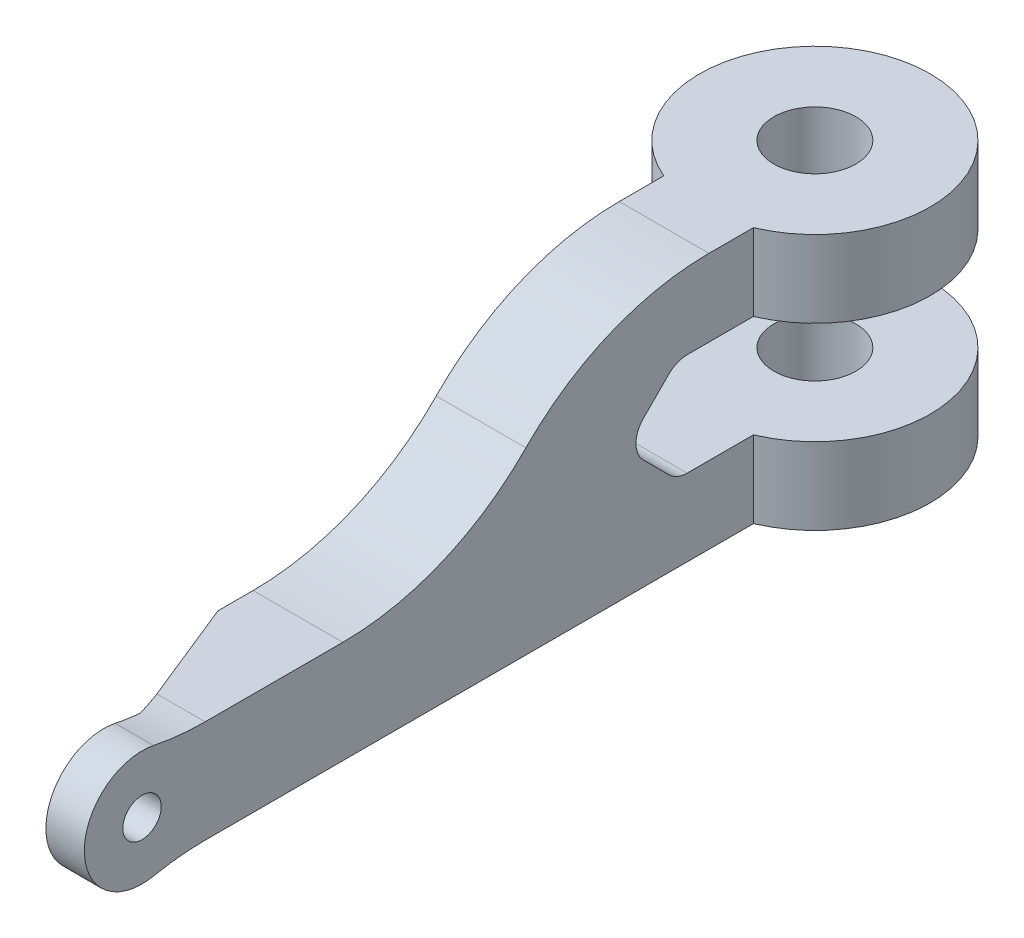
ISO-10303-21;
HEADER;
FILE_DESCRIPTION(('STEP AP214'),'2;1');
FILE_NAME('part.step','',(''),(''),'','','');
FILE_SCHEMA(('AUTOMOTIVE_DESIGN { 1 0 10303 214 1 1 1 1 }'));
ENDSEC;
DATA;
#1=APPLICATION_CONTEXT('core data for automotive mechanical design processes');
#2=APPLICATION_PROTOCOL_DEFINITION('international standard','automotive_design',2000,#1);
#3=PRODUCT_CONTEXT('',#1,'mechanical');
#4=PRODUCT('Part','Part','',(#3));
#5=PRODUCT_RELATED_PRODUCT_CATEGORY('part','',(#4));
#6=PRODUCT_DEFINITION_FORMATION('','',#4);
#7=PRODUCT_DEFINITION_CONTEXT('part definition',#1,'design');
#8=PRODUCT_DEFINITION('design','',#6,#7);
#9=PRODUCT_DEFINITION_SHAPE('','',#8);
#10=(LENGTH_UNIT() NAMED_UNIT(*) SI_UNIT(.MILLI.,.METRE.));
#11=(NAMED_UNIT(*) PLANE_ANGLE_UNIT() SI_UNIT($,.RADIAN.));
#12=(NAMED_UNIT(*) SI_UNIT($,.STERADIAN.) SOLID_ANGLE_UNIT());
#13=UNCERTAINTY_MEASURE_WITH_UNIT(LENGTH_MEASURE(1.E-05),#10,'distance_accuracy_value','');
#14=(GEOMETRIC_REPRESENTATION_CONTEXT(3) GLOBAL_UNCERTAINTY_ASSIGNED_CONTEXT((#13)) GLOBAL_UNIT_ASSIGNED_CONTEXT((#10,
#11,#12)) REPRESENTATION_CONTEXT('',''));
#15=CARTESIAN_POINT('',(0.,0.,0.));
#16=DIRECTION('',(0.,0.,1.));
#17=DIRECTION('',(1.,0.,0.));
#18=AXIS2_PLACEMENT_3D('',#15,#16,#17);
#19=CARTESIAN_POINT('',(0.,3.,0.));
#20=DIRECTION('',(0.,-1.,0.));
#21=DIRECTION('',(0.,0.,-1.));
#22=AXIS2_PLACEMENT_3D('',#19,#20,#21);
#23=CYLINDRICAL_SURFACE('',#22,4.5);
#24=DIRECTION('',(0.,1.,0.));
#25=VECTOR('',#24,1.);
#26=CARTESIAN_POINT('',(1.75,0.,4.14578098794425));
#27=LINE('',#26,#25);
#28=CARTESIAN_POINT('',(1.75,0.,4.14578098794425));
#29=VERTEX_POINT('',#28);
#30=CARTESIAN_POINT('',(1.75,3.,4.14578098794425));
#31=VERTEX_POINT('',#30);
#32=EDGE_CURVE('E215',#29,#31,#27,.T.);
#33=ORIENTED_EDGE('',*,*,#32,.F.);
#34=CARTESIAN_POINT('',(0.,0.,0.));
#35=DIRECTION('',(0.,1.,0.));
#36=DIRECTION('',(0.,0.,1.));
#37=AXIS2_PLACEMENT_3D('',#34,#35,#36);
#38=CIRCLE('',#37,4.5);
#39=CARTESIAN_POINT('',(-1.75,0.,4.14578098794425));
#40=VERTEX_POINT('',#39);
#41=EDGE_CURVE('E228',#29,#40,#38,.T.);
#42=ORIENTED_EDGE('',*,*,#41,.T.);
#43=DIRECTION('',(0.,1.,0.));
#44=VECTOR('',#43,1.);
#45=CARTESIAN_POINT('',(-1.75,0.,4.14578098794425));
#46=LINE('',#45,#44);
#47=CARTESIAN_POINT('',(-1.75,3.,4.14578098794425));
#48=VERTEX_POINT('',#47);
#49=EDGE_CURVE('E219',#40,#48,#46,.T.);
#50=ORIENTED_EDGE('',*,*,#49,.T.);
#51=CARTESIAN_POINT('',(0.,3.,0.));
#52=DIRECTION('',(0.,1.,0.));
#53=DIRECTION('',(0.,0.,1.));
#54=AXIS2_PLACEMENT_3D('',#51,#52,#53);
#55=CIRCLE('',#54,4.5);
#56=EDGE_CURVE('E231',#31,#48,#55,.T.);
#57=ORIENTED_EDGE('',*,*,#56,.F.);
#58=EDGE_LOOP('',(#33,#42,#50,#57));
#59=FACE_BOUND('',#58,.T.);
#60=ADVANCED_FACE('F37',(#59),#23,.T.);
#61=CARTESIAN_POINT('',(0.,3.,0.));
#62=DIRECTION('',(0.,1.,0.));
#63=DIRECTION('',(0.,0.,1.));
#64=AXIS2_PLACEMENT_3D('',#61,#62,#63);
#65=PLANE('',#64);
#66=DIRECTION('',(0.,0.,1.));
#67=VECTOR('',#66,1.);
#68=CARTESIAN_POINT('',(-1.75,3.,7.14578098794425));
#69=LINE('',#68,#67);
#70=CARTESIAN_POINT('',(-1.75,3.,6.73156742557115));
#71=VERTEX_POINT('',#70);
#72=EDGE_CURVE('E183',#48,#71,#69,.T.);
#73=ORIENTED_EDGE('',*,*,#72,.T.);
#74=DIRECTION('',(-1.,0.,0.));
#75=VECTOR('',#74,1.);
#76=CARTESIAN_POINT('',(0.,3.,6.73156742557115));
#77=LINE('',#76,#75);
#78=CARTESIAN_POINT('',(1.75,3.,6.73156742557115));
#79=VERTEX_POINT('',#78);
#80=EDGE_CURVE('E280',#71,#79,#77,.F.);
#81=ORIENTED_EDGE('',*,*,#80,.T.);
#82=DIRECTION('',(0.,0.,1.));
#83=VECTOR('',#82,1.);
#84=CARTESIAN_POINT('',(1.75,3.,0.));
#85=LINE('',#84,#83);
#86=EDGE_CURVE('E359',#31,#79,#85,.T.);
#87=ORIENTED_EDGE('',*,*,#86,.F.);
#88=ORIENTED_EDGE('',*,*,#56,.T.);
#89=EDGE_LOOP('',(#73,#81,#87,#88));
#90=FACE_BOUND('',#89,.T.);
#91=CARTESIAN_POINT('',(0.,3.,0.));
#92=DIRECTION('',(0.,1.,0.));
#93=DIRECTION('',(0.,0.,1.));
#94=AXIS2_PLACEMENT_3D('',#91,#92,#93);
#95=CIRCLE('',#94,1.6);
#96=CARTESIAN_POINT('',(0.,3.,1.6));
#97=VERTEX_POINT('',#96);
#98=EDGE_CURVE('E225',#97,#97,#95,.T.);
#99=ORIENTED_EDGE('',*,*,#98,.F.);
#100=EDGE_LOOP('',(#99));
#101=FACE_BOUND('',#100,.T.);
#102=ADVANCED_FACE('F387',(#90,#101),#65,.T.);
#103=CARTESIAN_POINT('',(0.,0.,0.));
#104=DIRECTION('',(0.,1.,0.));
#105=DIRECTION('',(0.,0.,1.));
#106=AXIS2_PLACEMENT_3D('',#103,#104,#105);
#107=PLANE('',#106);
#108=DIRECTION('',(1.,0.,0.));
#109=VECTOR('',#108,1.);
#110=CARTESIAN_POINT('',(-1.75,0.,25.537785549551));
#111=LINE('',#110,#109);
#112=CARTESIAN_POINT('',(-0.133895096659366,0.,25.537785549551));
#113=VERTEX_POINT('',#112);
#114=CARTESIAN_POINT('',(-0.129999999999994,0.,25.537785549551));
#115=VERTEX_POINT('',#114);
#116=EDGE_CURVE('E324',#113,#115,#111,.T.);
#117=ORIENTED_EDGE('',*,*,#116,.F.);
#118=DIRECTION('',(-0.37460659341591,0.,-0.927183854566788));
#119=VECTOR('',#118,1.);
#120=CARTESIAN_POINT('',(-0.133895096659366,0.,25.537785549551));
#121=LINE('',#120,#119);
#122=CARTESIAN_POINT('',(-1.75,0.,21.5377855495509));
#123=VERTEX_POINT('',#122);
#124=EDGE_CURVE('E297',#113,#123,#121,.T.);
#125=ORIENTED_EDGE('',*,*,#124,.T.);
#126=DIRECTION('',(0.,0.,1.));
#127=VECTOR('',#126,1.);
#128=CARTESIAN_POINT('',(-1.75,0.,0.));
#129=LINE('',#128,#127);
#130=EDGE_CURVE('E213',#40,#123,#129,.T.);
#131=ORIENTED_EDGE('',*,*,#130,.F.);
#132=ORIENTED_EDGE('',*,*,#41,.F.);
#133=DIRECTION('',(0.,0.,1.));
#134=VECTOR('',#133,1.);
#135=CARTESIAN_POINT('',(1.75,0.,0.));
#136=LINE('',#135,#134);
#137=CARTESIAN_POINT('',(1.75,0.,25.537785549551));
#138=VERTEX_POINT('',#137);
#139=EDGE_CURVE('E211',#29,#138,#136,.T.);
#140=ORIENTED_EDGE('',*,*,#139,.T.);
#141=DIRECTION('',(1.,0.,0.));
#142=VECTOR('',#141,1.);
#143=CARTESIAN_POINT('',(0.,0.,25.537785549551));
#144=LINE('',#143,#142);
#145=EDGE_CURVE('E53',#138,#115,#144,.F.);
#146=ORIENTED_EDGE('',*,*,#145,.T.);
#147=EDGE_LOOP('',(#117,#125,#131,#132,#140,#146));
#148=FACE_BOUND('',#147,.T.);
#149=CARTESIAN_POINT('',(0.,0.,0.));
#150=DIRECTION('',(0.,1.,0.));
#151=DIRECTION('',(0.,0.,1.));
#152=AXIS2_PLACEMENT_3D('',#149,#150,#151);
#153=CIRCLE('',#152,1.6);
#154=CARTESIAN_POINT('',(0.,0.,1.6));
#155=VERTEX_POINT('',#154);
#156=EDGE_CURVE('E222',#155,#155,#153,.T.);
#157=ORIENTED_EDGE('',*,*,#156,.T.);
#158=EDGE_LOOP('',(#157));
#159=FACE_BOUND('',#158,.T.);
#160=ADVANCED_FACE('F394',(#148,#159),#107,.F.);
#161=CARTESIAN_POINT('',(0.,3.,0.));
#162=DIRECTION('',(0.,-1.,0.));
#163=DIRECTION('',(0.,0.,-1.));
#164=AXIS2_PLACEMENT_3D('',#161,#162,#163);
#165=CYLINDRICAL_SURFACE('',#164,1.6);
#166=ORIENTED_EDGE('',*,*,#98,.T.);
#167=EDGE_LOOP('',(#166));
#168=FACE_BOUND('',#167,.T.);
#169=ORIENTED_EDGE('',*,*,#156,.F.);
#170=EDGE_LOOP('',(#169));
#171=FACE_BOUND('',#170,.T.);
#172=ADVANCED_FACE('F553',(#168,#171),#165,.F.);
#173=CARTESIAN_POINT('',(1.75,0.,0.));
#174=DIRECTION('',(-1.,0.,0.));
#175=DIRECTION('',(0.,0.,1.));
#176=AXIS2_PLACEMENT_3D('',#173,#174,#175);
#177=PLANE('',#176);
#178=DIRECTION('',(0.,0.,1.));
#179=VECTOR('',#178,1.);
#180=CARTESIAN_POINT('',(1.75,10.,0.));
#181=LINE('',#180,#179);
#182=CARTESIAN_POINT('',(1.75,10.,4.14578098794425));
#183=VERTEX_POINT('',#182);
#184=CARTESIAN_POINT('',(1.75,10.,5.88229453282598));
#185=VERTEX_POINT('',#184);
#186=EDGE_CURVE('E210',#183,#185,#181,.T.);
#187=ORIENTED_EDGE('',*,*,#186,.T.);
#188=CARTESIAN_POINT('',(1.75,0.,5.88229453282598));
#189=DIRECTION('',(-1.,0.,0.));
#190=DIRECTION('',(0.,0.,1.));
#191=AXIS2_PLACEMENT_3D('',#188,#189,#190);
#192=CIRCLE('',#191,10.);
#193=CARTESIAN_POINT('',(1.75,7.,13.0237229613688));
#194=VERTEX_POINT('',#193);
#195=EDGE_CURVE('E263',#185,#194,#192,.F.);
#196=ORIENTED_EDGE('',*,*,#195,.T.);
#197=CARTESIAN_POINT('',(1.75,14.,20.1651513899117));
#198=DIRECTION('',(-1.,0.,0.));
#199=DIRECTION('',(0.,0.,1.));
#200=AXIS2_PLACEMENT_3D('',#197,#198,#199);
#201=CIRCLE('',#200,10.);
#202=CARTESIAN_POINT('',(1.75,4.,20.1651513899117));
#203=VERTEX_POINT('',#202);
#204=EDGE_CURVE('E249',#194,#203,#201,.T.);
#205=ORIENTED_EDGE('',*,*,#204,.T.);
#206=DIRECTION('',(0.,0.,-1.));
#207=VECTOR('',#206,1.);
#208=CARTESIAN_POINT('',(1.75,4.,28.));
#209=LINE('',#208,#207);
#210=CARTESIAN_POINT('',(1.75,4.,25.537785549551));
#211=VERTEX_POINT('',#210);
#212=EDGE_CURVE('E184',#211,#203,#209,.T.);
#213=ORIENTED_EDGE('',*,*,#212,.F.);
#214=CARTESIAN_POINT('',(1.75,14.,25.537785549551));
#215=DIRECTION('',(-1.,0.,0.));
#216=DIRECTION('',(0.,0.,1.));
#217=AXIS2_PLACEMENT_3D('',#214,#215,#216);
#218=CIRCLE('',#217,10.);
#219=CARTESIAN_POINT('',(1.75,4.20408163265306,27.5477565295094));
#220=VERTEX_POINT('',#219);
#221=EDGE_CURVE('E251',#211,#220,#218,.T.);
#222=ORIENTED_EDGE('',*,*,#221,.T.);
#223=CARTESIAN_POINT('',(1.75,2.,28.));
#224=DIRECTION('',(1.,0.,0.));
#225=DIRECTION('',(0.,0.,-1.));
#226=AXIS2_PLACEMENT_3D('',#223,#224,#225);
#227=CIRCLE('',#226,2.25);
#228=CARTESIAN_POINT('',(1.75,-0.204081632653063,27.5477565295094));
#229=VERTEX_POINT('',#228);
#230=EDGE_CURVE('E334',#220,#229,#227,.T.);
#231=ORIENTED_EDGE('',*,*,#230,.T.);
#232=CARTESIAN_POINT('',(1.75,-10.,25.537785549551));
#233=DIRECTION('',(-1.,0.,0.));
#234=DIRECTION('',(0.,0.,1.));
#235=AXIS2_PLACEMENT_3D('',#232,#233,#234);
#236=CIRCLE('',#235,10.);
#237=EDGE_CURVE('E258',#229,#138,#236,.T.);
#238=ORIENTED_EDGE('',*,*,#237,.T.);
#239=ORIENTED_EDGE('',*,*,#139,.F.);
#240=ORIENTED_EDGE('',*,*,#32,.T.);
#241=ORIENTED_EDGE('',*,*,#86,.T.);
#242=CARTESIAN_POINT('',(1.75,4.,6.73156742557115));
#243=DIRECTION('',(-1.,0.,0.));
#244=DIRECTION('',(0.,0.,1.));
#245=AXIS2_PLACEMENT_3D('',#242,#243,#244);
#246=CIRCLE('',#245,1.);
#247=CARTESIAN_POINT('',(1.75,3.29289321881345,7.4386742067577));
#248=VERTEX_POINT('',#247);
#249=EDGE_CURVE('E292',#79,#248,#246,.T.);
#250=ORIENTED_EDGE('',*,*,#249,.T.);
#251=DIRECTION('',(0.,0.707106781186548,0.707106781186547));
#252=VECTOR('',#251,1.);
#253=CARTESIAN_POINT('',(1.75,-2.07289049397213,2.07289049397213));
#254=LINE('',#253,#252);
#255=CARTESIAN_POINT('',(1.75,4.29289321881345,8.4386742067577));
#256=VERTEX_POINT('',#255);
#257=EDGE_CURVE('E362',#248,#256,#254,.T.);
#258=ORIENTED_EDGE('',*,*,#257,.T.);
#259=CARTESIAN_POINT('',(1.75,5.,7.73156742557115));
#260=DIRECTION('',(-1.,0.,0.));
#261=DIRECTION('',(0.,0.,1.));
#262=AXIS2_PLACEMENT_3D('',#259,#260,#261);
#263=CIRCLE('',#262,1.);
#264=CARTESIAN_POINT('',(1.75,5.70710678118655,8.4386742067577));
#265=VERTEX_POINT('',#264);
#266=EDGE_CURVE('E288',#256,#265,#263,.T.);
#267=ORIENTED_EDGE('',*,*,#266,.T.);
#268=DIRECTION('',(0.,0.707106781186548,-0.707106781186547));
#269=VECTOR('',#268,1.);
#270=CARTESIAN_POINT('',(1.75,7.07289049397212,7.07289049397213));
#271=LINE('',#270,#269);
#272=CARTESIAN_POINT('',(1.75,6.70710678118655,7.4386742067577));
#273=VERTEX_POINT('',#272);
#274=EDGE_CURVE('E365',#265,#273,#271,.T.);
#275=ORIENTED_EDGE('',*,*,#274,.T.);
#276=CARTESIAN_POINT('',(1.75,6.,6.73156742557115));
#277=DIRECTION('',(-1.,0.,0.));
#278=DIRECTION('',(0.,0.,1.));
#279=AXIS2_PLACEMENT_3D('',#276,#277,#278);
#280=CIRCLE('',#279,1.);
#281=CARTESIAN_POINT('',(1.75,7.,6.73156742557115));
#282=VERTEX_POINT('',#281);
#283=EDGE_CURVE('E284',#273,#282,#280,.T.);
#284=ORIENTED_EDGE('',*,*,#283,.T.);
#285=DIRECTION('',(0.,0.,-1.));
#286=VECTOR('',#285,1.);
#287=CARTESIAN_POINT('',(1.75,7.,0.));
#288=LINE('',#287,#286);
#289=CARTESIAN_POINT('',(1.75,7.,4.14578098794425));
#290=VERTEX_POINT('',#289);
#291=EDGE_CURVE('E357',#282,#290,#288,.T.);
#292=ORIENTED_EDGE('',*,*,#291,.T.);
#293=DIRECTION('',(0.,-1.,0.));
#294=VECTOR('',#293,1.);
#295=CARTESIAN_POINT('',(1.75,10.,4.14578098794425));
#296=LINE('',#295,#294);
#297=EDGE_CURVE('E195',#183,#290,#296,.T.);
#298=ORIENTED_EDGE('',*,*,#297,.F.);
#299=EDGE_LOOP('',(#187,#196,#205,#213,#222,#231,#238,#239,#240,#241,#250,#258,#267,#275,#284,
#292,#298));
#300=FACE_BOUND('',#299,.T.);
#301=CARTESIAN_POINT('',(1.75,2.,28.));
#302=DIRECTION('',(1.,0.,0.));
#303=DIRECTION('',(0.,0.,-1.));
#304=AXIS2_PLACEMENT_3D('',#301,#302,#303);
#305=CIRCLE('',#304,0.750000000000002);
#306=CARTESIAN_POINT('',(1.75,2.,27.25));
#307=VERTEX_POINT('',#306);
#308=EDGE_CURVE('E341',#307,#307,#305,.T.);
#309=ORIENTED_EDGE('',*,*,#308,.F.);
#310=EDGE_LOOP('',(#309));
#311=FACE_BOUND('',#310,.T.);
#312=ADVANCED_FACE('F446',(#300,#311),#177,.F.);
#313=CARTESIAN_POINT('',(-1.75,0.,0.));
#314=DIRECTION('',(-1.,0.,0.));
#315=DIRECTION('',(0.,0.,1.));
#316=AXIS2_PLACEMENT_3D('',#313,#314,#315);
#317=PLANE('',#316);
#318=ORIENTED_EDGE('',*,*,#130,.T.);
#319=DIRECTION('',(0.,1.,0.));
#320=VECTOR('',#319,1.);
#321=CARTESIAN_POINT('',(-1.75,4.,21.5377855495509));
#322=LINE('',#321,#320);
#323=CARTESIAN_POINT('',(-1.75,4.,21.5377855495509));
#324=VERTEX_POINT('',#323);
#325=EDGE_CURVE('E299',#123,#324,#322,.T.);
#326=ORIENTED_EDGE('',*,*,#325,.T.);
#327=DIRECTION('',(0.,0.,-1.));
#328=VECTOR('',#327,1.);
#329=CARTESIAN_POINT('',(-1.75,4.,28.));
#330=LINE('',#329,#328);
#331=CARTESIAN_POINT('',(-1.75,4.,20.1651513899117));
#332=VERTEX_POINT('',#331);
#333=EDGE_CURVE('E346',#324,#332,#330,.T.);
#334=ORIENTED_EDGE('',*,*,#333,.T.);
#335=CARTESIAN_POINT('',(-1.75,14.,20.1651513899117));
#336=DIRECTION('',(-1.,0.,0.));
#337=DIRECTION('',(0.,0.,1.));
#338=AXIS2_PLACEMENT_3D('',#335,#336,#337);
#339=CIRCLE('',#338,10.);
#340=CARTESIAN_POINT('',(-1.75,7.,13.0237229613688));
#341=VERTEX_POINT('',#340);
#342=EDGE_CURVE('E246',#332,#341,#339,.F.);
#343=ORIENTED_EDGE('',*,*,#342,.T.);
#344=CARTESIAN_POINT('',(-1.75,0.,5.88229453282598));
#345=DIRECTION('',(-1.,0.,0.));
#346=DIRECTION('',(0.,0.,1.));
#347=AXIS2_PLACEMENT_3D('',#344,#345,#346);
#348=CIRCLE('',#347,10.);
#349=CARTESIAN_POINT('',(-1.75,10.,5.88229453282598));
#350=VERTEX_POINT('',#349);
#351=EDGE_CURVE('E267',#341,#350,#348,.T.);
#352=ORIENTED_EDGE('',*,*,#351,.T.);
#353=DIRECTION('',(0.,0.,1.));
#354=VECTOR('',#353,1.);
#355=CARTESIAN_POINT('',(-1.75,10.,0.));
#356=LINE('',#355,#354);
#357=CARTESIAN_POINT('',(-1.75,10.,4.14578098794425));
#358=VERTEX_POINT('',#357);
#359=EDGE_CURVE('E191',#358,#350,#356,.T.);
#360=ORIENTED_EDGE('',*,*,#359,.F.);
#361=DIRECTION('',(0.,-1.,0.));
#362=VECTOR('',#361,1.);
#363=CARTESIAN_POINT('',(-1.75,10.,4.14578098794425));
#364=LINE('',#363,#362);
#365=CARTESIAN_POINT('',(-1.75,7.,4.14578098794425));
#366=VERTEX_POINT('',#365);
#367=EDGE_CURVE('E187',#358,#366,#364,.T.);
#368=ORIENTED_EDGE('',*,*,#367,.T.);
#369=DIRECTION('',(0.,0.,-1.));
#370=VECTOR('',#369,1.);
#371=CARTESIAN_POINT('',(-1.75,7.,4.14578098794425));
#372=LINE('',#371,#370);
#373=CARTESIAN_POINT('',(-1.75,7.,6.73156742557115));
#374=VERTEX_POINT('',#373);
#375=EDGE_CURVE('E173',#374,#366,#372,.T.);
#376=ORIENTED_EDGE('',*,*,#375,.F.);
#377=CARTESIAN_POINT('',(-1.75,6.,6.73156742557115));
#378=DIRECTION('',(-1.,0.,0.));
#379=DIRECTION('',(0.,0.,1.));
#380=AXIS2_PLACEMENT_3D('',#377,#378,#379);
#381=CIRCLE('',#380,1.);
#382=CARTESIAN_POINT('',(-1.75,6.70710678118655,7.4386742067577));
#383=VERTEX_POINT('',#382);
#384=EDGE_CURVE('E282',#374,#383,#381,.F.);
#385=ORIENTED_EDGE('',*,*,#384,.T.);
#386=DIRECTION('',(0.,0.707106781186548,-0.707106781186547));
#387=VECTOR('',#386,1.);
#388=CARTESIAN_POINT('',(-1.75,7.,7.14578098794425));
#389=LINE('',#388,#387);
#390=CARTESIAN_POINT('',(-1.75,5.70710678118655,8.4386742067577));
#391=VERTEX_POINT('',#390);
#392=EDGE_CURVE('E354',#391,#383,#389,.T.);
#393=ORIENTED_EDGE('',*,*,#392,.F.);
#394=CARTESIAN_POINT('',(-1.75,5.,7.73156742557115));
#395=DIRECTION('',(-1.,0.,0.));
#396=DIRECTION('',(0.,0.,1.));
#397=AXIS2_PLACEMENT_3D('',#394,#395,#396);
#398=CIRCLE('',#397,1.);
#399=CARTESIAN_POINT('',(-1.75,4.29289321881345,8.4386742067577));
#400=VERTEX_POINT('',#399);
#401=EDGE_CURVE('E286',#391,#400,#398,.F.);
#402=ORIENTED_EDGE('',*,*,#401,.T.);
#403=DIRECTION('',(0.,0.707106781186548,0.707106781186547));
#404=VECTOR('',#403,1.);
#405=CARTESIAN_POINT('',(-1.75,5.,9.14578098794425));
#406=LINE('',#405,#404);
#407=CARTESIAN_POINT('',(-1.75,3.29289321881345,7.4386742067577));
#408=VERTEX_POINT('',#407);
#409=EDGE_CURVE('E351',#408,#400,#406,.T.);
#410=ORIENTED_EDGE('',*,*,#409,.F.);
#411=CARTESIAN_POINT('',(-1.75,4.,6.73156742557115));
#412=DIRECTION('',(-1.,0.,0.));
#413=DIRECTION('',(0.,0.,1.));
#414=AXIS2_PLACEMENT_3D('',#411,#412,#413);
#415=CIRCLE('',#414,1.);
#416=EDGE_CURVE('E290',#408,#71,#415,.F.);
#417=ORIENTED_EDGE('',*,*,#416,.T.);
#418=ORIENTED_EDGE('',*,*,#72,.F.);
#419=ORIENTED_EDGE('',*,*,#49,.F.);
#420=EDGE_LOOP('',(#318,#326,#334,#343,#352,#360,#368,#376,#385,#393,#402,#410,#417,#418,#419));
#421=FACE_BOUND('',#420,.T.);
#422=ADVANCED_FACE('F189',(#421),#317,.T.);
#423=CARTESIAN_POINT('',(0.,10.,0.));
#424=DIRECTION('',(0.,1.,0.));
#425=DIRECTION('',(0.,0.,1.));
#426=AXIS2_PLACEMENT_3D('',#423,#424,#425);
#427=PLANE('',#426);
#428=ORIENTED_EDGE('',*,*,#359,.T.);
#429=DIRECTION('',(1.,0.,0.));
#430=VECTOR('',#429,1.);
#431=CARTESIAN_POINT('',(1.75,10.,5.88229453282598));
#432=LINE('',#431,#430);
#433=EDGE_CURVE('E260',#350,#185,#432,.T.);
#434=ORIENTED_EDGE('',*,*,#433,.T.);
#435=ORIENTED_EDGE('',*,*,#186,.F.);
#436=CARTESIAN_POINT('',(0.,10.,0.));
#437=DIRECTION('',(0.,1.,0.));
#438=DIRECTION('',(0.,0.,1.));
#439=AXIS2_PLACEMENT_3D('',#436,#437,#438);
#440=CIRCLE('',#439,4.5);
#441=EDGE_CURVE('E196',#183,#358,#440,.T.);
#442=ORIENTED_EDGE('',*,*,#441,.T.);
#443=EDGE_LOOP('',(#428,#434,#435,#442));
#444=FACE_BOUND('',#443,.T.);
#445=CARTESIAN_POINT('',(0.,10.,0.));
#446=DIRECTION('',(0.,1.,0.));
#447=DIRECTION('',(0.,0.,1.));
#448=AXIS2_PLACEMENT_3D('',#445,#446,#447);
#449=CIRCLE('',#448,1.6);
#450=CARTESIAN_POINT('',(0.,10.,1.6));
#451=VERTEX_POINT('',#450);
#452=EDGE_CURVE('E201',#451,#451,#449,.T.);
#453=ORIENTED_EDGE('',*,*,#452,.F.);
#454=EDGE_LOOP('',(#453));
#455=FACE_BOUND('',#454,.T.);
#456=ADVANCED_FACE('F461',(#444,#455),#427,.T.);
#457=CARTESIAN_POINT('',(0.,10.,0.));
#458=DIRECTION('',(0.,-1.,0.));
#459=DIRECTION('',(0.,0.,-1.));
#460=AXIS2_PLACEMENT_3D('',#457,#458,#459);
#461=CYLINDRICAL_SURFACE('',#460,4.5);
#462=ORIENTED_EDGE('',*,*,#441,.F.);
#463=ORIENTED_EDGE('',*,*,#297,.T.);
#464=CARTESIAN_POINT('',(0.,7.,0.));
#465=DIRECTION('',(0.,1.,0.));
#466=DIRECTION('',(0.,0.,1.));
#467=AXIS2_PLACEMENT_3D('',#464,#465,#466);
#468=CIRCLE('',#467,4.5);
#469=EDGE_CURVE('E179',#290,#366,#468,.T.);
#470=ORIENTED_EDGE('',*,*,#469,.T.);
#471=ORIENTED_EDGE('',*,*,#367,.F.);
#472=EDGE_LOOP('',(#462,#463,#470,#471));
#473=FACE_BOUND('',#472,.T.);
#474=ADVANCED_FACE('F199',(#473),#461,.T.);
#475=CARTESIAN_POINT('',(0.,7.,0.));
#476=DIRECTION('',(0.,1.,0.));
#477=DIRECTION('',(0.,0.,1.));
#478=AXIS2_PLACEMENT_3D('',#475,#476,#477);
#479=PLANE('',#478);
#480=ORIENTED_EDGE('',*,*,#291,.F.);
#481=DIRECTION('',(-1.,0.,0.));
#482=VECTOR('',#481,1.);
#483=CARTESIAN_POINT('',(-1.75,7.,6.73156742557115));
#484=LINE('',#483,#482);
#485=EDGE_CURVE('E181',#282,#374,#484,.T.);
#486=ORIENTED_EDGE('',*,*,#485,.T.);
#487=ORIENTED_EDGE('',*,*,#375,.T.);
#488=ORIENTED_EDGE('',*,*,#469,.F.);
#489=EDGE_LOOP('',(#480,#486,#487,#488));
#490=FACE_BOUND('',#489,.T.);
#491=CARTESIAN_POINT('',(0.,7.,0.));
#492=DIRECTION('',(0.,1.,0.));
#493=DIRECTION('',(0.,0.,1.));
#494=AXIS2_PLACEMENT_3D('',#491,#492,#493);
#495=CIRCLE('',#494,1.6);
#496=CARTESIAN_POINT('',(0.,7.,1.6));
#497=VERTEX_POINT('',#496);
#498=EDGE_CURVE('E205',#497,#497,#495,.T.);
#499=ORIENTED_EDGE('',*,*,#498,.T.);
#500=EDGE_LOOP('',(#499));
#501=FACE_BOUND('',#500,.T.);
#502=ADVANCED_FACE('F176',(#490,#501),#479,.F.);
#503=CARTESIAN_POINT('',(0.,10.,0.));
#504=DIRECTION('',(0.,-1.,0.));
#505=DIRECTION('',(0.,0.,-1.));
#506=AXIS2_PLACEMENT_3D('',#503,#504,#505);
#507=CYLINDRICAL_SURFACE('',#506,1.6);
#508=ORIENTED_EDGE('',*,*,#452,.T.);
#509=EDGE_LOOP('',(#508));
#510=FACE_BOUND('',#509,.T.);
#511=ORIENTED_EDGE('',*,*,#498,.F.);
#512=EDGE_LOOP('',(#511));
#513=FACE_BOUND('',#512,.T.);
#514=ADVANCED_FACE('F370',(#510,#513),#507,.F.);
#515=CARTESIAN_POINT('',(4.5,7.,7.14578098794425));
#516=DIRECTION('',(0.,0.707106781186547,0.707106781186548));
#517=DIRECTION('',(0.,-0.707106781186548,0.707106781186547));
#518=AXIS2_PLACEMENT_3D('',#515,#516,#517);
#519=PLANE('',#518);
#520=ORIENTED_EDGE('',*,*,#392,.T.);
#521=DIRECTION('',(-1.,0.,0.));
#522=VECTOR('',#521,1.);
#523=CARTESIAN_POINT('',(1.75,6.70710678118655,7.4386742067577));
#524=LINE('',#523,#522);
#525=EDGE_CURVE('E273',#383,#273,#524,.F.);
#526=ORIENTED_EDGE('',*,*,#525,.T.);
#527=ORIENTED_EDGE('',*,*,#274,.F.);
#528=DIRECTION('',(-1.,0.,0.));
#529=VECTOR('',#528,1.);
#530=CARTESIAN_POINT('',(-1.75,5.70710678118655,8.4386742067577));
#531=LINE('',#530,#529);
#532=EDGE_CURVE('E270',#265,#391,#531,.T.);
#533=ORIENTED_EDGE('',*,*,#532,.T.);
#534=EDGE_LOOP('',(#520,#526,#527,#533));
#535=FACE_BOUND('',#534,.T.);
#536=ADVANCED_FACE('F372',(#535),#519,.F.);
#537=CARTESIAN_POINT('',(4.5,5.,9.14578098794425));
#538=DIRECTION('',(0.,-0.707106781186547,0.707106781186548));
#539=DIRECTION('',(0.,-0.707106781186548,-0.707106781186547));
#540=AXIS2_PLACEMENT_3D('',#537,#538,#539);
#541=PLANE('',#540);
#542=ORIENTED_EDGE('',*,*,#409,.T.);
#543=DIRECTION('',(-1.,0.,0.));
#544=VECTOR('',#543,1.);
#545=CARTESIAN_POINT('',(1.75,4.29289321881345,8.4386742067577));
#546=LINE('',#545,#544);
#547=EDGE_CURVE('E278',#400,#256,#546,.F.);
#548=ORIENTED_EDGE('',*,*,#547,.T.);
#549=ORIENTED_EDGE('',*,*,#257,.F.);
#550=DIRECTION('',(-1.,0.,0.));
#551=VECTOR('',#550,1.);
#552=CARTESIAN_POINT('',(4.5,3.29289321881345,7.4386742067577));
#553=LINE('',#552,#551);
#554=EDGE_CURVE('E275',#248,#408,#553,.T.);
#555=ORIENTED_EDGE('',*,*,#554,.T.);
#556=EDGE_LOOP('',(#542,#548,#549,#555));
#557=FACE_BOUND('',#556,.T.);
#558=ADVANCED_FACE('F380',(#557),#541,.F.);
#559=CARTESIAN_POINT('',(-1.75,4.,28.));
#560=DIRECTION('',(0.,-1.,0.));
#561=DIRECTION('',(0.,0.,-1.));
#562=AXIS2_PLACEMENT_3D('',#559,#560,#561);
#563=PLANE('',#562);
#564=ORIENTED_EDGE('',*,*,#333,.F.);
#565=DIRECTION('',(0.37460659341591,0.,0.927183854566788));
#566=VECTOR('',#565,1.);
#567=CARTESIAN_POINT('',(-0.133895096659366,4.,25.537785549551));
#568=LINE('',#567,#566);
#569=CARTESIAN_POINT('',(-0.133895096659366,4.,25.537785549551));
#570=VERTEX_POINT('',#569);
#571=EDGE_CURVE('E301',#324,#570,#568,.T.);
#572=ORIENTED_EDGE('',*,*,#571,.T.);
#573=DIRECTION('',(1.,0.,0.));
#574=VECTOR('',#573,1.);
#575=CARTESIAN_POINT('',(-1.75,4.,25.537785549551));
#576=LINE('',#575,#574);
#577=CARTESIAN_POINT('',(-0.129999999999994,4.,25.537785549551));
#578=VERTEX_POINT('',#577);
#579=EDGE_CURVE('E322',#570,#578,#576,.T.);
#580=ORIENTED_EDGE('',*,*,#579,.T.);
#581=DIRECTION('',(1.,0.,0.));
#582=VECTOR('',#581,1.);
#583=CARTESIAN_POINT('',(-1.75,4.,25.537785549551));
#584=LINE('',#583,#582);
#585=EDGE_CURVE('E234',#578,#211,#584,.T.);
#586=ORIENTED_EDGE('',*,*,#585,.T.);
#587=ORIENTED_EDGE('',*,*,#212,.T.);
#588=DIRECTION('',(-1.,0.,0.));
#589=VECTOR('',#588,1.);
#590=CARTESIAN_POINT('',(-1.75,4.,20.1651513899117));
#591=LINE('',#590,#589);
#592=EDGE_CURVE('E238',#203,#332,#591,.T.);
#593=ORIENTED_EDGE('',*,*,#592,.T.);
#594=EDGE_LOOP('',(#564,#572,#580,#586,#587,#593));
#595=FACE_BOUND('',#594,.T.);
#596=ADVANCED_FACE('F327',(#595),#563,.F.);
#597=CARTESIAN_POINT('',(-4.5,2.,28.));
#598=DIRECTION('',(1.,0.,0.));
#599=DIRECTION('',(0.,0.,-1.));
#600=AXIS2_PLACEMENT_3D('',#597,#598,#599);
#601=CYLINDRICAL_SURFACE('',#600,0.750000000000002);
#602=CARTESIAN_POINT('',(0.250000000000003,2.,28.));
#603=DIRECTION('',(1.,0.,0.));
#604=DIRECTION('',(0.,0.,-1.));
#605=AXIS2_PLACEMENT_3D('',#602,#603,#604);
#606=CIRCLE('',#605,0.750000000000002);
#607=CARTESIAN_POINT('',(0.250000000000004,2.,27.25));
#608=VERTEX_POINT('',#607);
#609=EDGE_CURVE('E331',#608,#608,#606,.T.);
#610=CARTESIAN_POINT('',(1.75,2.,27.25));
#611=CARTESIAN_POINT('',(1.734375,2.,27.25));
#612=CARTESIAN_POINT('',(1.71875,2.,27.25));
#613=CARTESIAN_POINT('',(1.6875,2.,27.25));
#614=CARTESIAN_POINT('',(1.671875,2.,27.25));
#615=CARTESIAN_POINT('',(1.640625,2.,27.25));
#616=CARTESIAN_POINT('',(1.625,2.,27.25));
#617=CARTESIAN_POINT('',(1.59375,2.,27.25));
#618=CARTESIAN_POINT('',(1.578125,2.,27.25));
#619=CARTESIAN_POINT('',(1.546875,2.,27.25));
#620=CARTESIAN_POINT('',(1.53125,2.,27.25));
#621=CARTESIAN_POINT('',(1.5,2.,27.25));
#622=CARTESIAN_POINT('',(1.484375,2.,27.25));
#623=CARTESIAN_POINT('',(1.453125,2.,27.25));
#624=CARTESIAN_POINT('',(1.4375,2.,27.25));
#625=CARTESIAN_POINT('',(1.40625,2.,27.25));
#626=CARTESIAN_POINT('',(1.390625,2.,27.25));
#627=CARTESIAN_POINT('',(1.359375,2.,27.25));
#628=CARTESIAN_POINT('',(1.34375,2.,27.25));
#629=CARTESIAN_POINT('',(1.3125,2.,27.25));
#630=CARTESIAN_POINT('',(1.296875,2.,27.25));
#631=CARTESIAN_POINT('',(1.265625,2.,27.25));
#632=CARTESIAN_POINT('',(1.25,2.,27.25));
#633=CARTESIAN_POINT('',(1.21875,2.,27.25));
#634=CARTESIAN_POINT('',(1.203125,2.,27.25));
#635=CARTESIAN_POINT('',(1.171875,2.,27.25));
#636=CARTESIAN_POINT('',(1.15625,2.,27.25));
#637=CARTESIAN_POINT('',(1.125,2.,27.25));
#638=CARTESIAN_POINT('',(1.109375,2.,27.25));
#639=CARTESIAN_POINT('',(1.078125,2.,27.25));
#640=CARTESIAN_POINT('',(1.0625,2.,27.25));
#641=CARTESIAN_POINT('',(1.03125,2.,27.25));
#642=CARTESIAN_POINT('',(1.015625,2.,27.25));
#643=CARTESIAN_POINT('',(0.984375000000003,2.,27.25));
#644=CARTESIAN_POINT('',(0.968750000000003,2.,27.25));
#645=CARTESIAN_POINT('',(0.937500000000003,2.,27.25));
#646=CARTESIAN_POINT('',(0.921875000000003,2.,27.25));
#647=CARTESIAN_POINT('',(0.890625000000003,2.,27.25));
#648=CARTESIAN_POINT('',(0.875000000000003,2.,27.25));
#649=CARTESIAN_POINT('',(0.843750000000003,2.,27.25));
#650=CARTESIAN_POINT('',(0.828125000000003,2.,27.25));
#651=CARTESIAN_POINT('',(0.796875000000003,2.,27.25));
#652=CARTESIAN_POINT('',(0.781250000000003,2.,27.25));
#653=CARTESIAN_POINT('',(0.750000000000004,2.,27.25));
#654=CARTESIAN_POINT('',(0.734375000000004,2.,27.25));
#655=CARTESIAN_POINT('',(0.703125000000004,2.,27.25));
#656=CARTESIAN_POINT('',(0.687500000000004,2.,27.25));
#657=CARTESIAN_POINT('',(0.656250000000004,2.,27.25));
#658=CARTESIAN_POINT('',(0.640625000000004,2.,27.25));
#659=CARTESIAN_POINT('',(0.609375000000004,2.,27.25));
#660=CARTESIAN_POINT('',(0.593750000000004,2.,27.25));
#661=CARTESIAN_POINT('',(0.562500000000004,2.,27.25));
#662=CARTESIAN_POINT('',(0.546875000000004,2.,27.25));
#663=CARTESIAN_POINT('',(0.515625000000004,2.,27.25));
#664=CARTESIAN_POINT('',(0.500000000000004,2.,27.25));
#665=CARTESIAN_POINT('',(0.468750000000004,2.,27.25));
#666=CARTESIAN_POINT('',(0.453125000000004,2.,27.25));
#667=CARTESIAN_POINT('',(0.421875000000004,2.,27.25));
#668=CARTESIAN_POINT('',(0.406250000000004,2.,27.25));
#669=CARTESIAN_POINT('',(0.375000000000004,2.,27.25));
#670=CARTESIAN_POINT('',(0.359375000000004,2.,27.25));
#671=CARTESIAN_POINT('',(0.328125000000004,2.,27.25));
#672=CARTESIAN_POINT('',(0.312500000000004,2.,27.25));
#673=CARTESIAN_POINT('',(0.281250000000004,2.,27.25));
#674=CARTESIAN_POINT('',(0.265625000000004,2.,27.25));
#675=CARTESIAN_POINT('',(0.250000000000004,2.,27.25));
#676=B_SPLINE_CURVE_WITH_KNOTS('',3,(#610,#611,#612,#613,#614,#615,#616,#617,#618,#619,#620,
#621,#622,#623,#624,#625,#626,#627,#628,#629,#630,#631,#632,#633,#634,#635,#636,#637,#638,#639,
#640,#641,#642,#643,#644,#645,#646,#647,#648,#649,#650,#651,#652,#653,#654,#655,#656,#657,#658,
#659,#660,#661,#662,#663,#664,#665,#666,#667,#668,#669,#670,#671,#672,#673,#674,#675),
.UNSPECIFIED.,.F.,.F.,(4,2,2,2,2,2,2,2,2,2,2,2,2,2,2,2,2,2,2,2,2,2,2,2,2,2,2,2,2,2,2,2,4),(0.,
0.046875,0.0937500000000001,0.140625,0.1875,0.234375,0.28125,0.328125,0.375,0.421875,0.46875,
0.515625,0.5625,0.609375,0.65625,0.703125,0.75,0.796875,0.84375,0.890625,0.9375,0.984375,
1.03125,1.078125,1.125,1.171875,1.21875,1.265625,1.3125,1.359375,1.40625,1.453125,1.5),.UNSPECIFIED.);
#677=EDGE_CURVE('BSEAM482',#307,#608,#676,.T.);
#678=ORIENTED_EDGE('',*,*,#308,.T.);
#679=ORIENTED_EDGE('',*,*,#609,.F.);
#680=ORIENTED_EDGE('',*,*,#677,.T.);
#681=ORIENTED_EDGE('',*,*,#677,.F.);
#682=EDGE_LOOP('',(#678,#680,#679,#681));
#683=FACE_BOUND('',#682,.T.);
#684=ADVANCED_FACE('F482',(#683),#601,.F.);
#685=CARTESIAN_POINT('',(0.250000000000003,2.,28.));
#686=DIRECTION('',(1.,0.,0.));
#687=DIRECTION('',(0.,0.,-1.));
#688=AXIS2_PLACEMENT_3D('',#685,#686,#687);
#689=CYLINDRICAL_SURFACE('',#688,2.25);
#690=ORIENTED_EDGE('',*,*,#230,.F.);
#691=DIRECTION('',(1.,0.,0.));
#692=VECTOR('',#691,1.);
#693=CARTESIAN_POINT('',(0.250000000000003,4.20408163265306,27.5477565295094));
#694=LINE('',#693,#692);
#695=CARTESIAN_POINT('',(0.250000000000003,4.20408163265306,27.5477565295094));
#696=VERTEX_POINT('',#695);
#697=EDGE_CURVE('E243',#220,#696,#694,.F.);
#698=ORIENTED_EDGE('',*,*,#697,.T.);
#699=CARTESIAN_POINT('',(0.250000000000003,2.,28.));
#700=DIRECTION('',(1.,0.,0.));
#701=DIRECTION('',(0.,0.,-1.));
#702=AXIS2_PLACEMENT_3D('',#699,#700,#701);
#703=CIRCLE('',#702,2.25);
#704=CARTESIAN_POINT('',(0.250000000000003,-0.204081632653063,27.5477565295094));
#705=VERTEX_POINT('',#704);
#706=EDGE_CURVE('E338',#696,#705,#703,.T.);
#707=ORIENTED_EDGE('',*,*,#706,.T.);
#708=DIRECTION('',(1.,0.,0.));
#709=VECTOR('',#708,1.);
#710=CARTESIAN_POINT('',(0.250000000000003,-0.204081632653063,27.5477565295094));
#711=LINE('',#710,#709);
#712=EDGE_CURVE('E241',#705,#229,#711,.T.);
#713=ORIENTED_EDGE('',*,*,#712,.T.);
#714=EDGE_LOOP('',(#690,#698,#707,#713));
#715=FACE_BOUND('',#714,.T.);
#716=ADVANCED_FACE('F472',(#715),#689,.T.);
#717=CARTESIAN_POINT('',(0.250000000000003,2.,28.));
#718=DIRECTION('',(1.,0.,0.));
#719=DIRECTION('',(0.,0.,-1.));
#720=AXIS2_PLACEMENT_3D('',#717,#718,#719);
#721=PLANE('',#720);
#722=ORIENTED_EDGE('',*,*,#609,.T.);
#723=EDGE_LOOP('',(#722));
#724=FACE_BOUND('',#723,.T.);
#725=CARTESIAN_POINT('',(0.250000000000003,14.,25.537785549551));
#726=DIRECTION('',(1.,0.,0.));
#727=DIRECTION('',(0.,0.,-1.));
#728=AXIS2_PLACEMENT_3D('',#725,#726,#727);
#729=CIRCLE('',#728,10.);
#730=CARTESIAN_POINT('',(0.250000000000003,4.0546504578978,26.5818269689437));
#731=VERTEX_POINT('',#730);
#732=EDGE_CURVE('E253',#696,#731,#729,.T.);
#733=ORIENTED_EDGE('',*,*,#732,.T.);
#734=DIRECTION('',(0.,-1.,0.));
#735=VECTOR('',#734,1.);
#736=CARTESIAN_POINT('',(0.250000000000003,0.,26.5818269689437));
#737=LINE('',#736,#735);
#738=CARTESIAN_POINT('',(0.250000000000003,-0.0546504578978046,26.5818269689437));
#739=VERTEX_POINT('',#738);
#740=EDGE_CURVE('E303',#731,#739,#737,.T.);
#741=ORIENTED_EDGE('',*,*,#740,.T.);
#742=CARTESIAN_POINT('',(0.250000000000003,-10.,25.537785549551));
#743=DIRECTION('',(1.,0.,0.));
#744=DIRECTION('',(0.,0.,-1.));
#745=AXIS2_PLACEMENT_3D('',#742,#743,#744);
#746=CIRCLE('',#745,10.);
#747=EDGE_CURVE('E256',#739,#705,#746,.T.);
#748=ORIENTED_EDGE('',*,*,#747,.T.);
#749=ORIENTED_EDGE('',*,*,#706,.F.);
#750=EDGE_LOOP('',(#733,#741,#748,#749));
#751=FACE_BOUND('',#750,.T.);
#752=ADVANCED_FACE('F404',(#724,#751),#721,.F.);
#753=CARTESIAN_POINT('',(0.,14.,20.1651513899117));
#754=DIRECTION('',(-1.,0.,0.));
#755=DIRECTION('',(0.,0.,1.));
#756=AXIS2_PLACEMENT_3D('',#753,#754,#755);
#757=CYLINDRICAL_SURFACE('',#756,10.);
#758=ORIENTED_EDGE('',*,*,#204,.F.);
#759=DIRECTION('',(-1.,0.,0.));
#760=VECTOR('',#759,1.);
#761=CARTESIAN_POINT('',(0.,7.,13.0237229613688));
#762=LINE('',#761,#760);
#763=EDGE_CURVE('E265',#194,#341,#762,.T.);
#764=ORIENTED_EDGE('',*,*,#763,.T.);
#765=ORIENTED_EDGE('',*,*,#342,.F.);
#766=ORIENTED_EDGE('',*,*,#592,.F.);
#767=EDGE_LOOP('',(#758,#764,#765,#766));
#768=FACE_BOUND('',#767,.T.);
#769=ADVANCED_FACE('F400',(#768),#757,.F.);
#770=CARTESIAN_POINT('',(0.250000000000003,14.,25.537785549551));
#771=DIRECTION('',(1.,0.,0.));
#772=DIRECTION('',(0.,0.,-1.));
#773=AXIS2_PLACEMENT_3D('',#770,#771,#772);
#774=CYLINDRICAL_SURFACE('',#773,10.);
#775=ORIENTED_EDGE('',*,*,#732,.F.);
#776=ORIENTED_EDGE('',*,*,#697,.F.);
#777=ORIENTED_EDGE('',*,*,#221,.F.);
#778=ORIENTED_EDGE('',*,*,#585,.F.);
#779=CARTESIAN_POINT('',(-0.129999999999994,14.,25.537785549551));
#780=DIRECTION('',(-0.93969262078591,0.,0.342020143325665));
#781=DIRECTION('',(0.342020143325665,0.,0.93969262078591));
#782=AXIS2_PLACEMENT_3D('',#779,#780,#781);
#783=ELLIPSE('',#782,10.6417777247591,10.);
#784=EDGE_CURVE('E11',#578,#731,#783,.T.);
#785=ORIENTED_EDGE('',*,*,#784,.T.);
#786=EDGE_LOOP('',(#775,#776,#777,#778,#785));
#787=FACE_BOUND('',#786,.T.);
#788=ADVANCED_FACE('F403',(#787),#774,.F.);
#789=CARTESIAN_POINT('',(0.250000000000003,-10.,25.537785549551));
#790=DIRECTION('',(1.,0.,0.));
#791=DIRECTION('',(0.,0.,-1.));
#792=AXIS2_PLACEMENT_3D('',#789,#790,#791);
#793=CYLINDRICAL_SURFACE('',#792,10.);
#794=ORIENTED_EDGE('',*,*,#237,.F.);
#795=ORIENTED_EDGE('',*,*,#712,.F.);
#796=ORIENTED_EDGE('',*,*,#747,.F.);
#797=CARTESIAN_POINT('',(-0.129999999999994,-10.,25.537785549551));
#798=DIRECTION('',(-0.93969262078591,0.,0.342020143325665));
#799=DIRECTION('',(0.342020143325665,0.,0.93969262078591));
#800=AXIS2_PLACEMENT_3D('',#797,#798,#799);
#801=ELLIPSE('',#800,10.6417777247591,10.);
#802=EDGE_CURVE('E47',#739,#115,#801,.T.);
#803=ORIENTED_EDGE('',*,*,#802,.T.);
#804=ORIENTED_EDGE('',*,*,#145,.F.);
#805=EDGE_LOOP('',(#794,#795,#796,#803,#804));
#806=FACE_BOUND('',#805,.T.);
#807=ADVANCED_FACE('F313',(#806),#793,.F.);
#808=CARTESIAN_POINT('',(0.,0.,5.88229453282598));
#809=DIRECTION('',(-1.,0.,0.));
#810=DIRECTION('',(0.,0.,1.));
#811=AXIS2_PLACEMENT_3D('',#808,#809,#810);
#812=CYLINDRICAL_SURFACE('',#811,10.);
#813=ORIENTED_EDGE('',*,*,#351,.F.);
#814=ORIENTED_EDGE('',*,*,#763,.F.);
#815=ORIENTED_EDGE('',*,*,#195,.F.);
#816=ORIENTED_EDGE('',*,*,#433,.F.);
#817=EDGE_LOOP('',(#813,#814,#815,#816));
#818=FACE_BOUND('',#817,.T.);
#819=ADVANCED_FACE('F411',(#818),#812,.T.);
#820=CARTESIAN_POINT('',(0.,6.,6.73156742557115));
#821=DIRECTION('',(1.,0.,0.));
#822=DIRECTION('',(0.,0.,-1.));
#823=AXIS2_PLACEMENT_3D('',#820,#821,#822);
#824=CYLINDRICAL_SURFACE('',#823,1.);
#825=ORIENTED_EDGE('',*,*,#283,.F.);
#826=ORIENTED_EDGE('',*,*,#525,.F.);
#827=ORIENTED_EDGE('',*,*,#384,.F.);
#828=ORIENTED_EDGE('',*,*,#485,.F.);
#829=EDGE_LOOP('',(#825,#826,#827,#828));
#830=FACE_BOUND('',#829,.T.);
#831=ADVANCED_FACE('F414',(#830),#824,.F.);
#832=CARTESIAN_POINT('',(4.5,5.,7.73156742557115));
#833=DIRECTION('',(1.,0.,0.));
#834=DIRECTION('',(0.,0.,-1.));
#835=AXIS2_PLACEMENT_3D('',#832,#833,#834);
#836=CYLINDRICAL_SURFACE('',#835,1.);
#837=ORIENTED_EDGE('',*,*,#266,.F.);
#838=ORIENTED_EDGE('',*,*,#547,.F.);
#839=ORIENTED_EDGE('',*,*,#401,.F.);
#840=ORIENTED_EDGE('',*,*,#532,.F.);
#841=EDGE_LOOP('',(#837,#838,#839,#840));
#842=FACE_BOUND('',#841,.T.);
#843=ADVANCED_FACE('F418',(#842),#836,.F.);
#844=CARTESIAN_POINT('',(4.5,4.,6.73156742557115));
#845=DIRECTION('',(-1.,0.,0.));
#846=DIRECTION('',(0.,0.,1.));
#847=AXIS2_PLACEMENT_3D('',#844,#845,#846);
#848=CYLINDRICAL_SURFACE('',#847,1.);
#849=ORIENTED_EDGE('',*,*,#249,.F.);
#850=ORIENTED_EDGE('',*,*,#80,.F.);
#851=ORIENTED_EDGE('',*,*,#416,.F.);
#852=ORIENTED_EDGE('',*,*,#554,.F.);
#853=EDGE_LOOP('',(#849,#850,#851,#852));
#854=FACE_BOUND('',#853,.T.);
#855=ADVANCED_FACE('F422',(#854),#848,.F.);
#856=CARTESIAN_POINT('',(-1.75,10.,25.537785549551));
#857=DIRECTION('',(0.,0.,-1.));
#858=DIRECTION('',(-1.,0.,0.));
#859=AXIS2_PLACEMENT_3D('',#856,#857,#858);
#860=PLANE('',#859);
#861=ORIENTED_EDGE('',*,*,#116,.T.);
#862=DIRECTION('',(0.,1.,0.));
#863=VECTOR('',#862,1.);
#864=CARTESIAN_POINT('',(-0.129999999999994,4.,25.537785549551));
#865=LINE('',#864,#863);
#866=EDGE_CURVE('E306',#115,#578,#865,.T.);
#867=ORIENTED_EDGE('',*,*,#866,.T.);
#868=ORIENTED_EDGE('',*,*,#579,.F.);
#869=DIRECTION('',(0.,-1.,0.));
#870=VECTOR('',#869,1.);
#871=CARTESIAN_POINT('',(-0.133895096659366,0.,25.537785549551));
#872=LINE('',#871,#870);
#873=EDGE_CURVE('E294',#570,#113,#872,.T.);
#874=ORIENTED_EDGE('',*,*,#873,.T.);
#875=EDGE_LOOP('',(#861,#867,#868,#874));
#876=FACE_BOUND('',#875,.T.);
#877=ADVANCED_FACE('F321',(#876),#860,.F.);
#878=CARTESIAN_POINT('',(-0.133895096659366,10.,25.537785549551));
#879=DIRECTION('',(-0.927183854566788,0.,0.37460659341591));
#880=DIRECTION('',(0.,1.,0.));
#881=AXIS2_PLACEMENT_3D('',#878,#879,#880);
#882=PLANE('',#881);
#883=ORIENTED_EDGE('',*,*,#571,.F.);
#884=ORIENTED_EDGE('',*,*,#325,.F.);
#885=ORIENTED_EDGE('',*,*,#124,.F.);
#886=ORIENTED_EDGE('',*,*,#873,.F.);
#887=EDGE_LOOP('',(#883,#884,#885,#886));
#888=FACE_BOUND('',#887,.T.);
#889=ADVANCED_FACE('F427',(#888),#882,.T.);
#890=CARTESIAN_POINT('',(0.250000000000003,2.,26.5818269689437));
#891=DIRECTION('',(-0.93969262078591,0.,0.342020143325665));
#892=DIRECTION('',(0.,1.,0.));
#893=AXIS2_PLACEMENT_3D('',#890,#891,#892);
#894=PLANE('',#893);
#895=ORIENTED_EDGE('',*,*,#784,.F.);
#896=ORIENTED_EDGE('',*,*,#866,.F.);
#897=ORIENTED_EDGE('',*,*,#802,.F.);
#898=ORIENTED_EDGE('',*,*,#740,.F.);
#899=EDGE_LOOP('',(#895,#896,#897,#898));
#900=FACE_BOUND('',#899,.T.);
#901=ADVANCED_FACE('F40',(#900),#894,.T.);
#902=CLOSED_SHELL('',(#60,#102,#160,#172,#312,#422,#456,#474,#502,#514,#536,#558,#596,#684,#716,
#752,#769,#788,#807,#819,#831,#843,#855,#877,#889,#901));
#903=MANIFOLD_SOLID_BREP('B2',#902);
#904=ADVANCED_BREP_SHAPE_REPRESENTATION('',(#18,#903),#14);
#905=SHAPE_DEFINITION_REPRESENTATION(#9,#904);
ENDSEC;
END-ISO-10303-21;
